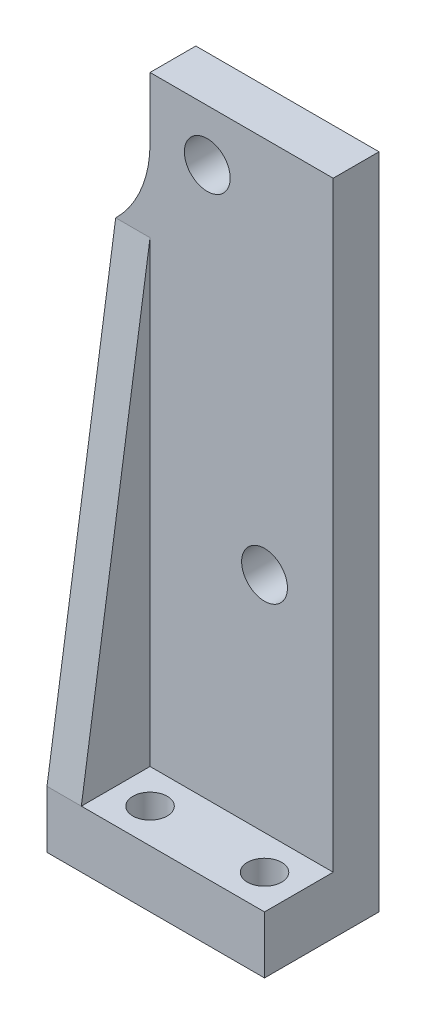
ISO-10303-21;
HEADER;
FILE_DESCRIPTION(('STEP AP214'),'2;1');
FILE_NAME('part.step','',(''),(''),'','','');
FILE_SCHEMA(('AUTOMOTIVE_DESIGN { 1 0 10303 214 1 1 1 1 }'));
ENDSEC;
DATA;
#1=APPLICATION_CONTEXT('core data for automotive mechanical design processes');
#2=APPLICATION_PROTOCOL_DEFINITION('international standard','automotive_design',2000,#1);
#3=PRODUCT_CONTEXT('',#1,'mechanical');
#4=PRODUCT('Part','Part','',(#3));
#5=PRODUCT_RELATED_PRODUCT_CATEGORY('part','',(#4));
#6=PRODUCT_DEFINITION_FORMATION('','',#4);
#7=PRODUCT_DEFINITION_CONTEXT('part definition',#1,'design');
#8=PRODUCT_DEFINITION('design','',#6,#7);
#9=PRODUCT_DEFINITION_SHAPE('','',#8);
#10=(LENGTH_UNIT() NAMED_UNIT(*) SI_UNIT(.MILLI.,.METRE.));
#11=(NAMED_UNIT(*) PLANE_ANGLE_UNIT() SI_UNIT($,.RADIAN.));
#12=(NAMED_UNIT(*) SI_UNIT($,.STERADIAN.) SOLID_ANGLE_UNIT());
#13=UNCERTAINTY_MEASURE_WITH_UNIT(LENGTH_MEASURE(1.E-05),#10,'distance_accuracy_value','');
#14=(GEOMETRIC_REPRESENTATION_CONTEXT(3) GLOBAL_UNCERTAINTY_ASSIGNED_CONTEXT((#13)) GLOBAL_UNIT_ASSIGNED_CONTEXT((#10,
#11,#12)) REPRESENTATION_CONTEXT('',''));
#15=CARTESIAN_POINT('',(0.,0.,0.));
#16=DIRECTION('',(0.,0.,1.));
#17=DIRECTION('',(1.,0.,0.));
#18=AXIS2_PLACEMENT_3D('',#15,#16,#17);
#19=CARTESIAN_POINT('',(-10.,5.,0.));
#20=DIRECTION('',(1.,0.,0.));
#21=DIRECTION('',(0.,0.,-1.));
#22=AXIS2_PLACEMENT_3D('',#19,#20,#21);
#23=PLANE('',#22);
#24=DIRECTION('',(0.,-1.,0.));
#25=VECTOR('',#24,1.);
#26=CARTESIAN_POINT('',(-9.99999999999999,57.5,-7.));
#27=LINE('',#26,#25);
#28=CARTESIAN_POINT('',(-9.99999999999999,57.5,-7.));
#29=VERTEX_POINT('',#28);
#30=CARTESIAN_POINT('',(-9.99999999999999,52.1414284285429,-7.));
#31=VERTEX_POINT('',#30);
#32=EDGE_CURVE('E158',#29,#31,#27,.T.);
#33=ORIENTED_EDGE('',*,*,#32,.T.);
#34=DIRECTION('',(0.,0.,-1.));
#35=VECTOR('',#34,1.);
#36=CARTESIAN_POINT('',(-10.,52.1414284285429,0.));
#37=LINE('',#36,#35);
#38=CARTESIAN_POINT('',(-9.99999999999999,52.1414284285429,-3.));
#39=VERTEX_POINT('',#38);
#40=EDGE_CURVE('E202',#31,#39,#37,.F.);
#41=ORIENTED_EDGE('',*,*,#40,.T.);
#42=DIRECTION('',(0.,-1.,0.));
#43=VECTOR('',#42,1.);
#44=CARTESIAN_POINT('',(-9.99999999999999,57.5,-3.));
#45=LINE('',#44,#43);
#46=CARTESIAN_POINT('',(-9.99999999999999,57.5,-3.));
#47=VERTEX_POINT('',#46);
#48=EDGE_CURVE('E152',#47,#39,#45,.T.);
#49=ORIENTED_EDGE('',*,*,#48,.F.);
#50=DIRECTION('',(0.,0.,1.));
#51=VECTOR('',#50,1.);
#52=CARTESIAN_POINT('',(-9.99999999999999,57.5,-7.));
#53=LINE('',#52,#51);
#54=EDGE_CURVE('E170',#29,#47,#53,.T.);
#55=ORIENTED_EDGE('',*,*,#54,.F.);
#56=EDGE_LOOP('',(#33,#41,#49,#55));
#57=FACE_BOUND('',#56,.T.);
#58=ADVANCED_FACE('F37',(#57),#23,.F.);
#59=CARTESIAN_POINT('',(-5.,53.,3.));
#60=DIRECTION('',(0.,0.,-1.));
#61=DIRECTION('',(-1.,0.,0.));
#62=AXIS2_PLACEMENT_3D('',#59,#60,#61);
#63=CYLINDRICAL_SURFACE('',#62,2.);
#64=CARTESIAN_POINT('',(-5.,53.,-3.));
#65=DIRECTION('',(0.,0.,1.));
#66=DIRECTION('',(1.,0.,0.));
#67=AXIS2_PLACEMENT_3D('',#64,#65,#66);
#68=CIRCLE('',#67,2.);
#69=CARTESIAN_POINT('',(-3.,53.,-3.));
#70=VERTEX_POINT('',#69);
#71=EDGE_CURVE('E164',#70,#70,#68,.T.);
#72=ORIENTED_EDGE('',*,*,#71,.T.);
#73=EDGE_LOOP('',(#72));
#74=FACE_BOUND('',#73,.T.);
#75=CARTESIAN_POINT('',(-5.,53.,-6.));
#76=DIRECTION('',(0.,0.,-1.));
#77=DIRECTION('',(-1.,0.,0.));
#78=AXIS2_PLACEMENT_3D('',#75,#76,#77);
#79=CIRCLE('',#78,2.);
#80=CARTESIAN_POINT('',(-7.,53.,-6.));
#81=VERTEX_POINT('',#80);
#82=EDGE_CURVE('E142',#81,#81,#79,.F.);
#83=ORIENTED_EDGE('',*,*,#82,.F.);
#84=EDGE_LOOP('',(#83));
#85=FACE_BOUND('',#84,.T.);
#86=ADVANCED_FACE('F239',(#74,#85),#63,.F.);
#87=CARTESIAN_POINT('',(0.,5.,3.));
#88=DIRECTION('',(0.,0.,-1.));
#89=DIRECTION('',(-1.,0.,0.));
#90=AXIS2_PLACEMENT_3D('',#87,#88,#89);
#91=PLANE('',#90);
#92=DIRECTION('',(1.,0.,0.));
#93=VECTOR('',#92,1.);
#94=CARTESIAN_POINT('',(0.,0.,3.));
#95=LINE('',#94,#93);
#96=CARTESIAN_POINT('',(-13.,0.,3.));
#97=VERTEX_POINT('',#96);
#98=CARTESIAN_POINT('',(6.,0.,3.));
#99=VERTEX_POINT('',#98);
#100=EDGE_CURVE('E197',#97,#99,#95,.T.);
#101=ORIENTED_EDGE('',*,*,#100,.T.);
#102=DIRECTION('',(0.,-1.,0.));
#103=VECTOR('',#102,1.);
#104=CARTESIAN_POINT('',(6.,5.,3.));
#105=LINE('',#104,#103);
#106=CARTESIAN_POINT('',(6.,5.,3.));
#107=VERTEX_POINT('',#106);
#108=EDGE_CURVE('E191',#107,#99,#105,.T.);
#109=ORIENTED_EDGE('',*,*,#108,.F.);
#110=DIRECTION('',(1.,0.,0.));
#111=VECTOR('',#110,1.);
#112=CARTESIAN_POINT('',(0.,5.,3.));
#113=LINE('',#112,#111);
#114=CARTESIAN_POINT('',(-10.,5.,3.));
#115=VERTEX_POINT('',#114);
#116=EDGE_CURVE('E130',#115,#107,#113,.T.);
#117=ORIENTED_EDGE('',*,*,#116,.F.);
#118=DIRECTION('',(1.,0.,0.));
#119=VECTOR('',#118,1.);
#120=CARTESIAN_POINT('',(-13.,5.,3.));
#121=LINE('',#120,#119);
#122=CARTESIAN_POINT('',(-13.,5.,3.));
#123=VERTEX_POINT('',#122);
#124=EDGE_CURVE('E112',#123,#115,#121,.T.);
#125=ORIENTED_EDGE('',*,*,#124,.F.);
#126=DIRECTION('',(0.,1.,0.));
#127=VECTOR('',#126,1.);
#128=CARTESIAN_POINT('',(-13.,0.,3.));
#129=LINE('',#128,#127);
#130=EDGE_CURVE('E115',#97,#123,#129,.T.);
#131=ORIENTED_EDGE('',*,*,#130,.F.);
#132=EDGE_LOOP('',(#101,#109,#117,#125,#131));
#133=FACE_BOUND('',#132,.T.);
#134=ADVANCED_FACE('F128',(#133),#91,.F.);
#135=CARTESIAN_POINT('',(6.,5.,0.));
#136=DIRECTION('',(1.,0.,0.));
#137=DIRECTION('',(0.,0.,-1.));
#138=AXIS2_PLACEMENT_3D('',#135,#136,#137);
#139=PLANE('',#138);
#140=DIRECTION('',(0.,0.,1.));
#141=VECTOR('',#140,1.);
#142=CARTESIAN_POINT('',(6.,0.,0.));
#143=LINE('',#142,#141);
#144=CARTESIAN_POINT('',(6.,0.,-7.));
#145=VERTEX_POINT('',#144);
#146=EDGE_CURVE('E179',#145,#99,#143,.T.);
#147=ORIENTED_EDGE('',*,*,#146,.F.);
#148=DIRECTION('',(0.,1.,0.));
#149=VECTOR('',#148,1.);
#150=CARTESIAN_POINT('',(6.,0.,-7.));
#151=LINE('',#150,#149);
#152=CARTESIAN_POINT('',(6.,57.5,-7.));
#153=VERTEX_POINT('',#152);
#154=EDGE_CURVE('E151',#145,#153,#151,.T.);
#155=ORIENTED_EDGE('',*,*,#154,.T.);
#156=DIRECTION('',(0.,0.,1.));
#157=VECTOR('',#156,1.);
#158=CARTESIAN_POINT('',(6.,57.5,-7.));
#159=LINE('',#158,#157);
#160=CARTESIAN_POINT('',(6.,57.5,-3.));
#161=VERTEX_POINT('',#160);
#162=EDGE_CURVE('E160',#153,#161,#159,.T.);
#163=ORIENTED_EDGE('',*,*,#162,.T.);
#164=DIRECTION('',(0.,1.,0.));
#165=VECTOR('',#164,1.);
#166=CARTESIAN_POINT('',(6.,0.,-3.));
#167=LINE('',#166,#165);
#168=CARTESIAN_POINT('',(6.,5.,-3.));
#169=VERTEX_POINT('',#168);
#170=EDGE_CURVE('E161',#169,#161,#167,.T.);
#171=ORIENTED_EDGE('',*,*,#170,.F.);
#172=DIRECTION('',(0.,0.,1.));
#173=VECTOR('',#172,1.);
#174=CARTESIAN_POINT('',(6.,5.,0.));
#175=LINE('',#174,#173);
#176=EDGE_CURVE('E183',#169,#107,#175,.T.);
#177=ORIENTED_EDGE('',*,*,#176,.T.);
#178=ORIENTED_EDGE('',*,*,#108,.T.);
#179=EDGE_LOOP('',(#147,#155,#163,#171,#177,#178));
#180=FACE_BOUND('',#179,.T.);
#181=ADVANCED_FACE('F223',(#180),#139,.T.);
#182=CARTESIAN_POINT('',(-7.,5.,0.));
#183=DIRECTION('',(0.,-1.,0.));
#184=DIRECTION('',(0.,0.,-1.));
#185=AXIS2_PLACEMENT_3D('',#182,#183,#184);
#186=CYLINDRICAL_SURFACE('',#185,1.5);
#187=CARTESIAN_POINT('',(-7.,5.,0.));
#188=DIRECTION('',(0.,1.,0.));
#189=DIRECTION('',(0.,0.,1.));
#190=AXIS2_PLACEMENT_3D('',#187,#188,#189);
#191=CIRCLE('',#190,1.5);
#192=CARTESIAN_POINT('',(-7.,5.,1.5));
#193=VERTEX_POINT('',#192);
#194=EDGE_CURVE('E178',#193,#193,#191,.T.);
#195=ORIENTED_EDGE('',*,*,#194,.T.);
#196=EDGE_LOOP('',(#195));
#197=FACE_BOUND('',#196,.T.);
#198=CARTESIAN_POINT('',(-7.,0.,0.));
#199=DIRECTION('',(0.,1.,0.));
#200=DIRECTION('',(0.,0.,1.));
#201=AXIS2_PLACEMENT_3D('',#198,#199,#200);
#202=CIRCLE('',#201,1.5);
#203=CARTESIAN_POINT('',(-7.,0.,1.5));
#204=VERTEX_POINT('',#203);
#205=EDGE_CURVE('E194',#204,#204,#202,.T.);
#206=ORIENTED_EDGE('',*,*,#205,.F.);
#207=EDGE_LOOP('',(#206));
#208=FACE_BOUND('',#207,.T.);
#209=ADVANCED_FACE('F253',(#197,#208),#186,.F.);
#210=CARTESIAN_POINT('',(3.,5.,0.));
#211=DIRECTION('',(0.,-1.,0.));
#212=DIRECTION('',(0.,0.,-1.));
#213=AXIS2_PLACEMENT_3D('',#210,#211,#212);
#214=CYLINDRICAL_SURFACE('',#213,1.5);
#215=CARTESIAN_POINT('',(3.,5.,0.));
#216=DIRECTION('',(0.,1.,0.));
#217=DIRECTION('',(0.,0.,1.));
#218=AXIS2_PLACEMENT_3D('',#215,#216,#217);
#219=CIRCLE('',#218,1.5);
#220=CARTESIAN_POINT('',(3.,5.,1.5));
#221=VERTEX_POINT('',#220);
#222=EDGE_CURVE('E175',#221,#221,#219,.T.);
#223=ORIENTED_EDGE('',*,*,#222,.T.);
#224=EDGE_LOOP('',(#223));
#225=FACE_BOUND('',#224,.T.);
#226=CARTESIAN_POINT('',(3.,0.,0.));
#227=DIRECTION('',(0.,1.,0.));
#228=DIRECTION('',(0.,0.,1.));
#229=AXIS2_PLACEMENT_3D('',#226,#227,#228);
#230=CIRCLE('',#229,1.5);
#231=CARTESIAN_POINT('',(3.,0.,1.5));
#232=VERTEX_POINT('',#231);
#233=EDGE_CURVE('E172',#232,#232,#230,.T.);
#234=ORIENTED_EDGE('',*,*,#233,.F.);
#235=EDGE_LOOP('',(#234));
#236=FACE_BOUND('',#235,.T.);
#237=ADVANCED_FACE('F257',(#225,#236),#214,.F.);
#238=CARTESIAN_POINT('',(0.,5.,0.));
#239=DIRECTION('',(0.,1.,0.));
#240=DIRECTION('',(0.,0.,1.));
#241=AXIS2_PLACEMENT_3D('',#238,#239,#240);
#242=PLANE('',#241);
#243=ORIENTED_EDGE('',*,*,#222,.F.);
#244=EDGE_LOOP('',(#243));
#245=FACE_BOUND('',#244,.T.);
#246=ORIENTED_EDGE('',*,*,#194,.F.);
#247=EDGE_LOOP('',(#246));
#248=FACE_BOUND('',#247,.T.);
#249=ORIENTED_EDGE('',*,*,#116,.T.);
#250=ORIENTED_EDGE('',*,*,#176,.F.);
#251=DIRECTION('',(1.,0.,0.));
#252=VECTOR('',#251,1.);
#253=CARTESIAN_POINT('',(0.,5.,-3.));
#254=LINE('',#253,#252);
#255=CARTESIAN_POINT('',(-10.,5.,-3.));
#256=VERTEX_POINT('',#255);
#257=EDGE_CURVE('E186',#256,#169,#254,.T.);
#258=ORIENTED_EDGE('',*,*,#257,.F.);
#259=DIRECTION('',(0.,0.,1.));
#260=VECTOR('',#259,1.);
#261=CARTESIAN_POINT('',(-10.,5.,0.));
#262=LINE('',#261,#260);
#263=EDGE_CURVE('E189',#256,#115,#262,.T.);
#264=ORIENTED_EDGE('',*,*,#263,.T.);
#265=EDGE_LOOP('',(#249,#250,#258,#264));
#266=FACE_BOUND('',#265,.T.);
#267=ADVANCED_FACE('F226',(#245,#248,#266),#242,.T.);
#268=CARTESIAN_POINT('',(0.,0.,0.));
#269=DIRECTION('',(0.,1.,0.));
#270=DIRECTION('',(0.,0.,1.));
#271=AXIS2_PLACEMENT_3D('',#268,#269,#270);
#272=PLANE('',#271);
#273=ORIENTED_EDGE('',*,*,#233,.T.);
#274=EDGE_LOOP('',(#273));
#275=FACE_BOUND('',#274,.T.);
#276=ORIENTED_EDGE('',*,*,#205,.T.);
#277=EDGE_LOOP('',(#276));
#278=FACE_BOUND('',#277,.T.);
#279=ORIENTED_EDGE('',*,*,#100,.F.);
#280=DIRECTION('',(0.,0.,1.));
#281=VECTOR('',#280,1.);
#282=CARTESIAN_POINT('',(-13.,0.,0.));
#283=LINE('',#282,#281);
#284=CARTESIAN_POINT('',(-13.,0.,-7.));
#285=VERTEX_POINT('',#284);
#286=EDGE_CURVE('E122',#285,#97,#283,.T.);
#287=ORIENTED_EDGE('',*,*,#286,.F.);
#288=DIRECTION('',(1.,0.,0.));
#289=VECTOR('',#288,1.);
#290=CARTESIAN_POINT('',(-10.,0.,-7.));
#291=LINE('',#290,#289);
#292=EDGE_CURVE('E148',#285,#145,#291,.T.);
#293=ORIENTED_EDGE('',*,*,#292,.T.);
#294=ORIENTED_EDGE('',*,*,#146,.T.);
#295=EDGE_LOOP('',(#279,#287,#293,#294));
#296=FACE_BOUND('',#295,.T.);
#297=ADVANCED_FACE('F220',(#275,#278,#296),#272,.F.);
#298=CARTESIAN_POINT('',(6.,57.5,-7.));
#299=DIRECTION('',(0.,1.,0.));
#300=DIRECTION('',(0.,0.,1.));
#301=AXIS2_PLACEMENT_3D('',#298,#299,#300);
#302=PLANE('',#301);
#303=DIRECTION('',(-1.,0.,0.));
#304=VECTOR('',#303,1.);
#305=CARTESIAN_POINT('',(6.,57.5,-3.));
#306=LINE('',#305,#304);
#307=EDGE_CURVE('E163',#161,#47,#306,.T.);
#308=ORIENTED_EDGE('',*,*,#307,.F.);
#309=ORIENTED_EDGE('',*,*,#162,.F.);
#310=DIRECTION('',(-1.,0.,0.));
#311=VECTOR('',#310,1.);
#312=CARTESIAN_POINT('',(6.,57.5,-7.));
#313=LINE('',#312,#311);
#314=EDGE_CURVE('E155',#153,#29,#313,.T.);
#315=ORIENTED_EDGE('',*,*,#314,.T.);
#316=ORIENTED_EDGE('',*,*,#54,.T.);
#317=EDGE_LOOP('',(#308,#309,#315,#316));
#318=FACE_BOUND('',#317,.T.);
#319=ADVANCED_FACE('F272',(#318),#302,.T.);
#320=CARTESIAN_POINT('',(0.,0.,-7.));
#321=DIRECTION('',(0.,0.,1.));
#322=DIRECTION('',(1.,0.,0.));
#323=AXIS2_PLACEMENT_3D('',#320,#321,#322);
#324=PLANE('',#323);
#325=CARTESIAN_POINT('',(-5.,53.,-7.));
#326=DIRECTION('',(0.,0.,-1.));
#327=DIRECTION('',(-1.,0.,0.));
#328=AXIS2_PLACEMENT_3D('',#325,#326,#327);
#329=CIRCLE('',#328,3.5);
#330=CARTESIAN_POINT('',(-8.5,53.,-7.));
#331=VERTEX_POINT('',#330);
#332=EDGE_CURVE('E132',#331,#331,#329,.T.);
#333=ORIENTED_EDGE('',*,*,#332,.F.);
#334=EDGE_LOOP('',(#333));
#335=FACE_BOUND('',#334,.T.);
#336=CARTESIAN_POINT('',(0.,24.5,-7.));
#337=DIRECTION('',(0.,0.,-1.));
#338=DIRECTION('',(-1.,0.,0.));
#339=AXIS2_PLACEMENT_3D('',#336,#337,#338);
#340=CIRCLE('',#339,2.);
#341=CARTESIAN_POINT('',(-2.,24.5,-7.));
#342=VERTEX_POINT('',#341);
#343=EDGE_CURVE('E144',#342,#342,#340,.T.);
#344=ORIENTED_EDGE('',*,*,#343,.F.);
#345=EDGE_LOOP('',(#344));
#346=FACE_BOUND('',#345,.T.);
#347=ORIENTED_EDGE('',*,*,#292,.F.);
#348=DIRECTION('',(0.,-1.,0.));
#349=VECTOR('',#348,1.);
#350=CARTESIAN_POINT('',(-13.,0.,-7.));
#351=LINE('',#350,#349);
#352=CARTESIAN_POINT('',(-13.,45.,-7.));
#353=VERTEX_POINT('',#352);
#354=EDGE_CURVE('E137',#353,#285,#351,.T.);
#355=ORIENTED_EDGE('',*,*,#354,.F.);
#356=CARTESIAN_POINT('',(-20.,52.1414284285429,-7.));
#357=DIRECTION('',(0.,0.,1.));
#358=DIRECTION('',(1.,0.,0.));
#359=AXIS2_PLACEMENT_3D('',#356,#357,#358);
#360=CIRCLE('',#359,10.);
#361=EDGE_CURVE('E60',#353,#31,#360,.T.);
#362=ORIENTED_EDGE('',*,*,#361,.T.);
#363=ORIENTED_EDGE('',*,*,#32,.F.);
#364=ORIENTED_EDGE('',*,*,#314,.F.);
#365=ORIENTED_EDGE('',*,*,#154,.F.);
#366=EDGE_LOOP('',(#347,#355,#362,#363,#364,#365));
#367=FACE_BOUND('',#366,.T.);
#368=ADVANCED_FACE('F279',(#335,#346,#367),#324,.F.);
#369=CARTESIAN_POINT('',(0.,0.,-3.));
#370=DIRECTION('',(0.,0.,1.));
#371=DIRECTION('',(1.,0.,0.));
#372=AXIS2_PLACEMENT_3D('',#369,#370,#371);
#373=PLANE('',#372);
#374=CARTESIAN_POINT('',(0.,24.5,-3.));
#375=DIRECTION('',(0.,0.,1.));
#376=DIRECTION('',(1.,0.,0.));
#377=AXIS2_PLACEMENT_3D('',#374,#375,#376);
#378=CIRCLE('',#377,2.);
#379=CARTESIAN_POINT('',(2.,24.5,-3.));
#380=VERTEX_POINT('',#379);
#381=EDGE_CURVE('E147',#380,#380,#378,.T.);
#382=ORIENTED_EDGE('',*,*,#381,.F.);
#383=EDGE_LOOP('',(#382));
#384=FACE_BOUND('',#383,.T.);
#385=ORIENTED_EDGE('',*,*,#71,.F.);
#386=EDGE_LOOP('',(#385));
#387=FACE_BOUND('',#386,.T.);
#388=ORIENTED_EDGE('',*,*,#48,.T.);
#389=CARTESIAN_POINT('',(-20.,52.1414284285429,-3.));
#390=DIRECTION('',(0.,0.,1.));
#391=DIRECTION('',(1.,0.,0.));
#392=AXIS2_PLACEMENT_3D('',#389,#390,#391);
#393=CIRCLE('',#392,10.);
#394=CARTESIAN_POINT('',(-13.,45.,-3.));
#395=VERTEX_POINT('',#394);
#396=EDGE_CURVE('E45',#39,#395,#393,.F.);
#397=ORIENTED_EDGE('',*,*,#396,.T.);
#398=DIRECTION('',(-1.,0.,0.));
#399=VECTOR('',#398,1.);
#400=CARTESIAN_POINT('',(-12.9999999999999,45.,-3.));
#401=LINE('',#400,#399);
#402=CARTESIAN_POINT('',(-9.99999999999999,45.0000000000002,-3.00000000000002));
#403=VERTEX_POINT('',#402);
#404=EDGE_CURVE('E11',#403,#395,#401,.T.);
#405=ORIENTED_EDGE('',*,*,#404,.F.);
#406=EDGE_CURVE('E167',#403,#256,#45,.T.);
#407=ORIENTED_EDGE('',*,*,#406,.T.);
#408=ORIENTED_EDGE('',*,*,#257,.T.);
#409=ORIENTED_EDGE('',*,*,#170,.T.);
#410=ORIENTED_EDGE('',*,*,#307,.T.);
#411=EDGE_LOOP('',(#388,#397,#405,#407,#408,#409,#410));
#412=FACE_BOUND('',#411,.T.);
#413=ADVANCED_FACE('F212',(#384,#387,#412),#373,.T.);
#414=CARTESIAN_POINT('',(0.,24.5,3.));
#415=DIRECTION('',(0.,0.,-1.));
#416=DIRECTION('',(-1.,0.,0.));
#417=AXIS2_PLACEMENT_3D('',#414,#415,#416);
#418=CYLINDRICAL_SURFACE('',#417,2.);
#419=ORIENTED_EDGE('',*,*,#381,.T.);
#420=EDGE_LOOP('',(#419));
#421=FACE_BOUND('',#420,.T.);
#422=ORIENTED_EDGE('',*,*,#343,.T.);
#423=EDGE_LOOP('',(#422));
#424=FACE_BOUND('',#423,.T.);
#425=ADVANCED_FACE('F290',(#421,#424),#418,.F.);
#426=CARTESIAN_POINT('',(-5.,53.,-6.));
#427=DIRECTION('',(0.,0.,-1.));
#428=DIRECTION('',(-1.,0.,0.));
#429=AXIS2_PLACEMENT_3D('',#426,#427,#428);
#430=PLANE('',#429);
#431=CARTESIAN_POINT('',(-5.,53.,-6.));
#432=DIRECTION('',(0.,0.,-1.));
#433=DIRECTION('',(-1.,0.,0.));
#434=AXIS2_PLACEMENT_3D('',#431,#432,#433);
#435=CIRCLE('',#434,3.5);
#436=CARTESIAN_POINT('',(-8.5,53.,-6.));
#437=VERTEX_POINT('',#436);
#438=EDGE_CURVE('E135',#437,#437,#435,.T.);
#439=ORIENTED_EDGE('',*,*,#438,.T.);
#440=EDGE_LOOP('',(#439));
#441=FACE_BOUND('',#440,.T.);
#442=ORIENTED_EDGE('',*,*,#82,.T.);
#443=EDGE_LOOP('',(#442));
#444=FACE_BOUND('',#443,.T.);
#445=ADVANCED_FACE('F295',(#441,#444),#430,.T.);
#446=CARTESIAN_POINT('',(-5.,53.,-6.));
#447=DIRECTION('',(0.,0.,-1.));
#448=DIRECTION('',(-1.,0.,0.));
#449=AXIS2_PLACEMENT_3D('',#446,#447,#448);
#450=CYLINDRICAL_SURFACE('',#449,3.5);
#451=ORIENTED_EDGE('',*,*,#438,.F.);
#452=EDGE_LOOP('',(#451));
#453=FACE_BOUND('',#452,.T.);
#454=ORIENTED_EDGE('',*,*,#332,.T.);
#455=EDGE_LOOP('',(#454));
#456=FACE_BOUND('',#455,.T.);
#457=ADVANCED_FACE('F297',(#453,#456),#450,.F.);
#458=CARTESIAN_POINT('',(-13.,0.550122249388753,3.66748166259169));
#459=DIRECTION('',(0.,-0.148340452930245,-0.988936352868298));
#460=DIRECTION('',(0.,0.988936352868298,-0.148340452930245));
#461=AXIS2_PLACEMENT_3D('',#458,#459,#460);
#462=PLANE('',#461);
#463=DIRECTION('',(0.,0.988936352868298,-0.148340452930245));
#464=VECTOR('',#463,1.);
#465=CARTESIAN_POINT('',(-10.,0.550122249388753,3.66748166259169));
#466=LINE('',#465,#464);
#467=EDGE_CURVE('E125',#115,#403,#466,.T.);
#468=ORIENTED_EDGE('',*,*,#467,.T.);
#469=ORIENTED_EDGE('',*,*,#404,.T.);
#470=DIRECTION('',(0.,0.988936352868298,-0.148340452930245));
#471=VECTOR('',#470,1.);
#472=CARTESIAN_POINT('',(-13.,0.550122249388753,3.66748166259169));
#473=LINE('',#472,#471);
#474=EDGE_CURVE('E52',#123,#395,#473,.T.);
#475=ORIENTED_EDGE('',*,*,#474,.F.);
#476=ORIENTED_EDGE('',*,*,#124,.T.);
#477=EDGE_LOOP('',(#468,#469,#475,#476));
#478=FACE_BOUND('',#477,.T.);
#479=ADVANCED_FACE('F110',(#478),#462,.F.);
#480=CARTESIAN_POINT('',(-13.,0.,0.));
#481=DIRECTION('',(-1.,0.,0.));
#482=DIRECTION('',(0.,0.,1.));
#483=AXIS2_PLACEMENT_3D('',#480,#481,#482);
#484=PLANE('',#483);
#485=ORIENTED_EDGE('',*,*,#130,.T.);
#486=ORIENTED_EDGE('',*,*,#474,.T.);
#487=DIRECTION('',(0.,0.,-1.));
#488=VECTOR('',#487,1.);
#489=CARTESIAN_POINT('',(-13.,45.,0.));
#490=LINE('',#489,#488);
#491=EDGE_CURVE('E114',#395,#353,#490,.T.);
#492=ORIENTED_EDGE('',*,*,#491,.T.);
#493=ORIENTED_EDGE('',*,*,#354,.T.);
#494=ORIENTED_EDGE('',*,*,#286,.T.);
#495=EDGE_LOOP('',(#485,#486,#492,#493,#494));
#496=FACE_BOUND('',#495,.T.);
#497=ADVANCED_FACE('F119',(#496),#484,.T.);
#498=CARTESIAN_POINT('',(-10.,0.,0.));
#499=DIRECTION('',(-1.,0.,0.));
#500=DIRECTION('',(0.,0.,1.));
#501=AXIS2_PLACEMENT_3D('',#498,#499,#500);
#502=PLANE('',#501);
#503=ORIENTED_EDGE('',*,*,#263,.F.);
#504=ORIENTED_EDGE('',*,*,#406,.F.);
#505=ORIENTED_EDGE('',*,*,#467,.F.);
#506=EDGE_LOOP('',(#503,#504,#505));
#507=FACE_BOUND('',#506,.T.);
#508=ADVANCED_FACE('F229',(#507),#502,.F.);
#509=CARTESIAN_POINT('',(-20.,52.1414284285429,0.));
#510=DIRECTION('',(0.,0.,-1.));
#511=DIRECTION('',(-1.,0.,0.));
#512=AXIS2_PLACEMENT_3D('',#509,#510,#511);
#513=CYLINDRICAL_SURFACE('',#512,10.);
#514=ORIENTED_EDGE('',*,*,#396,.F.);
#515=ORIENTED_EDGE('',*,*,#40,.F.);
#516=ORIENTED_EDGE('',*,*,#361,.F.);
#517=ORIENTED_EDGE('',*,*,#491,.F.);
#518=EDGE_LOOP('',(#514,#515,#516,#517));
#519=FACE_BOUND('',#518,.T.);
#520=ADVANCED_FACE('F39',(#519),#513,.F.);
#521=CLOSED_SHELL('',(#58,#86,#134,#181,#209,#237,#267,#297,#319,#368,#413,#425,#445,#457,#479,
#497,#508,#520));
#522=MANIFOLD_SOLID_BREP('B2',#521);
#523=ADVANCED_BREP_SHAPE_REPRESENTATION('',(#18,#522),#14);
#524=SHAPE_DEFINITION_REPRESENTATION(#9,#523);
ENDSEC;
END-ISO-10303-21;
